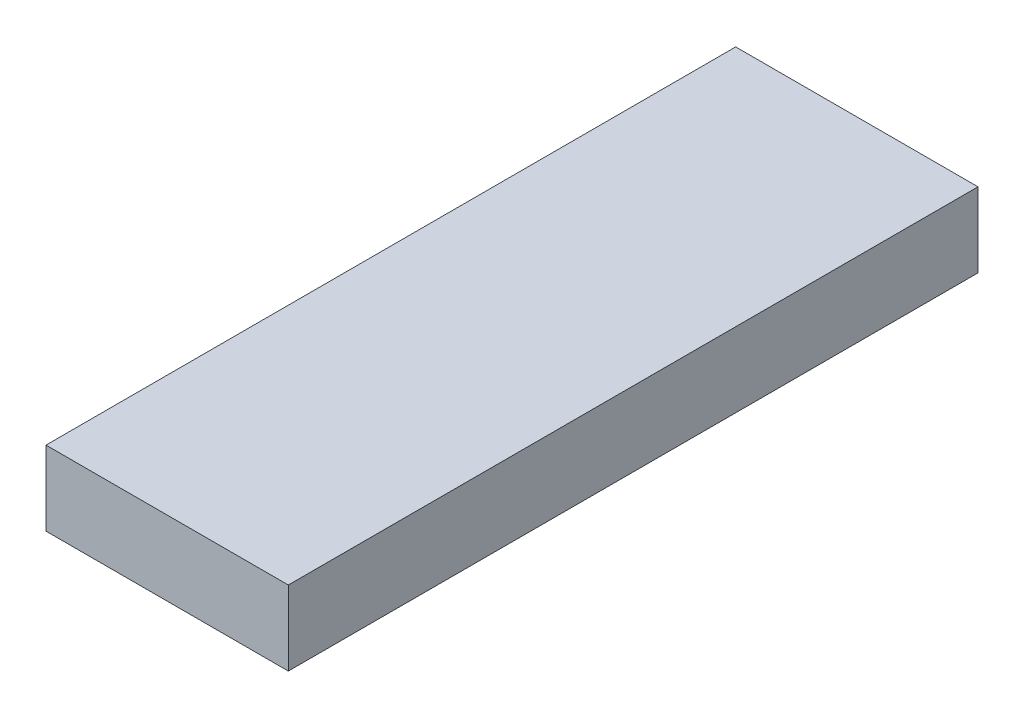
ISO-10303-21;
HEADER;
FILE_DESCRIPTION(('STEP AP214'),'2;1');
FILE_NAME('part.step','',(''),(''),'','','');
FILE_SCHEMA(('AUTOMOTIVE_DESIGN { 1 0 10303 214 1 1 1 1 }'));
ENDSEC;
DATA;
#1=APPLICATION_CONTEXT('core data for automotive mechanical design processes');
#2=APPLICATION_PROTOCOL_DEFINITION('international standard','automotive_design',2000,#1);
#3=PRODUCT_CONTEXT('',#1,'mechanical');
#4=PRODUCT('Part','Part','',(#3));
#5=PRODUCT_RELATED_PRODUCT_CATEGORY('part','',(#4));
#6=PRODUCT_DEFINITION_FORMATION('','',#4);
#7=PRODUCT_DEFINITION_CONTEXT('part definition',#1,'design');
#8=PRODUCT_DEFINITION('design','',#6,#7);
#9=PRODUCT_DEFINITION_SHAPE('','',#8);
#10=(LENGTH_UNIT() NAMED_UNIT(*) SI_UNIT(.MILLI.,.METRE.));
#11=(NAMED_UNIT(*) PLANE_ANGLE_UNIT() SI_UNIT($,.RADIAN.));
#12=(NAMED_UNIT(*) SI_UNIT($,.STERADIAN.) SOLID_ANGLE_UNIT());
#13=UNCERTAINTY_MEASURE_WITH_UNIT(LENGTH_MEASURE(1.E-05),#10,'distance_accuracy_value','');
#14=(GEOMETRIC_REPRESENTATION_CONTEXT(3) GLOBAL_UNCERTAINTY_ASSIGNED_CONTEXT((#13)) GLOBAL_UNIT_ASSIGNED_CONTEXT((#10,
#11,#12)) REPRESENTATION_CONTEXT('',''));
#15=CARTESIAN_POINT('',(0.,0.,0.));
#16=DIRECTION('',(0.,0.,1.));
#17=DIRECTION('',(1.,0.,0.));
#18=AXIS2_PLACEMENT_3D('',#15,#16,#17);
#19=CARTESIAN_POINT('',(0.,101.6,0.));
#20=DIRECTION('',(1.,0.,0.));
#21=DIRECTION('',(0.,0.,-1.));
#22=AXIS2_PLACEMENT_3D('',#19,#20,#21);
#23=PLANE('',#22);
#24=DIRECTION('',(0.,0.,1.));
#25=VECTOR('',#24,1.);
#26=CARTESIAN_POINT('',(0.,0.,0.));
#27=LINE('',#26,#25);
#28=CARTESIAN_POINT('',(0.,0.,-939.8));
#29=VERTEX_POINT('',#28);
#30=CARTESIAN_POINT('',(0.,0.,0.));
#31=VERTEX_POINT('',#30);
#32=EDGE_CURVE('E97',#29,#31,#27,.T.);
#33=ORIENTED_EDGE('',*,*,#32,.T.);
#34=DIRECTION('',(0.,-1.,0.));
#35=VECTOR('',#34,1.);
#36=CARTESIAN_POINT('',(0.,101.6,0.));
#37=LINE('',#36,#35);
#38=CARTESIAN_POINT('',(0.,101.6,0.));
#39=VERTEX_POINT('',#38);
#40=EDGE_CURVE('E11',#39,#31,#37,.T.);
#41=ORIENTED_EDGE('',*,*,#40,.F.);
#42=DIRECTION('',(0.,0.,1.));
#43=VECTOR('',#42,1.);
#44=CARTESIAN_POINT('',(0.,101.6,0.));
#45=LINE('',#44,#43);
#46=CARTESIAN_POINT('',(0.,101.6,-939.8));
#47=VERTEX_POINT('',#46);
#48=EDGE_CURVE('E85',#47,#39,#45,.T.);
#49=ORIENTED_EDGE('',*,*,#48,.F.);
#50=DIRECTION('',(0.,-1.,0.));
#51=VECTOR('',#50,1.);
#52=CARTESIAN_POINT('',(0.,101.6,-939.8));
#53=LINE('',#52,#51);
#54=EDGE_CURVE('E93',#47,#29,#53,.T.);
#55=ORIENTED_EDGE('',*,*,#54,.T.);
#56=EDGE_LOOP('',(#33,#41,#49,#55));
#57=FACE_BOUND('',#56,.T.);
#58=ADVANCED_FACE('F34',(#57),#23,.F.);
#59=CARTESIAN_POINT('',(0.,101.6,0.));
#60=DIRECTION('',(0.,0.,-1.));
#61=DIRECTION('',(-1.,0.,0.));
#62=AXIS2_PLACEMENT_3D('',#59,#60,#61);
#63=PLANE('',#62);
#64=DIRECTION('',(1.,0.,0.));
#65=VECTOR('',#64,1.);
#66=CARTESIAN_POINT('',(0.,0.,0.));
#67=LINE('',#66,#65);
#68=CARTESIAN_POINT('',(330.2,0.,0.));
#69=VERTEX_POINT('',#68);
#70=EDGE_CURVE('E89',#31,#69,#67,.T.);
#71=ORIENTED_EDGE('',*,*,#70,.T.);
#72=DIRECTION('',(0.,-1.,0.));
#73=VECTOR('',#72,1.);
#74=CARTESIAN_POINT('',(330.2,101.6,0.));
#75=LINE('',#74,#73);
#76=CARTESIAN_POINT('',(330.2,101.6,0.));
#77=VERTEX_POINT('',#76);
#78=EDGE_CURVE('E42',#77,#69,#75,.T.);
#79=ORIENTED_EDGE('',*,*,#78,.F.);
#80=DIRECTION('',(1.,0.,0.));
#81=VECTOR('',#80,1.);
#82=CARTESIAN_POINT('',(0.,101.6,0.));
#83=LINE('',#82,#81);
#84=EDGE_CURVE('E80',#39,#77,#83,.T.);
#85=ORIENTED_EDGE('',*,*,#84,.F.);
#86=ORIENTED_EDGE('',*,*,#40,.T.);
#87=EDGE_LOOP('',(#71,#79,#85,#86));
#88=FACE_BOUND('',#87,.T.);
#89=ADVANCED_FACE('F88',(#88),#63,.F.);
#90=CARTESIAN_POINT('',(330.2,101.6,0.));
#91=DIRECTION('',(-1.,0.,0.));
#92=DIRECTION('',(0.,0.,1.));
#93=AXIS2_PLACEMENT_3D('',#90,#91,#92);
#94=PLANE('',#93);
#95=DIRECTION('',(0.,0.,-1.));
#96=VECTOR('',#95,1.);
#97=CARTESIAN_POINT('',(330.2,0.,0.));
#98=LINE('',#97,#96);
#99=CARTESIAN_POINT('',(330.2,0.,-939.8));
#100=VERTEX_POINT('',#99);
#101=EDGE_CURVE('E67',#69,#100,#98,.T.);
#102=ORIENTED_EDGE('',*,*,#101,.T.);
#103=DIRECTION('',(0.,-1.,0.));
#104=VECTOR('',#103,1.);
#105=CARTESIAN_POINT('',(330.2,101.6,-939.8));
#106=LINE('',#105,#104);
#107=CARTESIAN_POINT('',(330.2,101.6,-939.8));
#108=VERTEX_POINT('',#107);
#109=EDGE_CURVE('E90',#108,#100,#106,.T.);
#110=ORIENTED_EDGE('',*,*,#109,.F.);
#111=DIRECTION('',(0.,0.,-1.));
#112=VECTOR('',#111,1.);
#113=CARTESIAN_POINT('',(330.2,101.6,0.));
#114=LINE('',#113,#112);
#115=EDGE_CURVE('E83',#77,#108,#114,.T.);
#116=ORIENTED_EDGE('',*,*,#115,.F.);
#117=ORIENTED_EDGE('',*,*,#78,.T.);
#118=EDGE_LOOP('',(#102,#110,#116,#117));
#119=FACE_BOUND('',#118,.T.);
#120=ADVANCED_FACE('F91',(#119),#94,.F.);
#121=CARTESIAN_POINT('',(0.,101.6,-939.8));
#122=DIRECTION('',(0.,0.,1.));
#123=DIRECTION('',(1.,0.,0.));
#124=AXIS2_PLACEMENT_3D('',#121,#122,#123);
#125=PLANE('',#124);
#126=DIRECTION('',(-1.,0.,0.));
#127=VECTOR('',#126,1.);
#128=CARTESIAN_POINT('',(0.,0.,-939.8));
#129=LINE('',#128,#127);
#130=EDGE_CURVE('E73',#100,#29,#129,.T.);
#131=ORIENTED_EDGE('',*,*,#130,.T.);
#132=ORIENTED_EDGE('',*,*,#54,.F.);
#133=DIRECTION('',(-1.,0.,0.));
#134=VECTOR('',#133,1.);
#135=CARTESIAN_POINT('',(0.,101.6,-939.8));
#136=LINE('',#135,#134);
#137=EDGE_CURVE('E50',#108,#47,#136,.T.);
#138=ORIENTED_EDGE('',*,*,#137,.F.);
#139=ORIENTED_EDGE('',*,*,#109,.T.);
#140=EDGE_LOOP('',(#131,#132,#138,#139));
#141=FACE_BOUND('',#140,.T.);
#142=ADVANCED_FACE('F104',(#141),#125,.F.);
#143=CARTESIAN_POINT('',(0.,101.6,0.));
#144=DIRECTION('',(0.,-1.,0.));
#145=DIRECTION('',(0.,0.,-1.));
#146=AXIS2_PLACEMENT_3D('',#143,#144,#145);
#147=PLANE('',#146);
#148=ORIENTED_EDGE('',*,*,#48,.T.);
#149=ORIENTED_EDGE('',*,*,#84,.T.);
#150=ORIENTED_EDGE('',*,*,#115,.T.);
#151=ORIENTED_EDGE('',*,*,#137,.T.);
#152=EDGE_LOOP('',(#148,#149,#150,#151));
#153=FACE_BOUND('',#152,.T.);
#154=ADVANCED_FACE('F81',(#153),#147,.F.);
#155=CARTESIAN_POINT('',(0.,0.,0.));
#156=DIRECTION('',(0.,-1.,0.));
#157=DIRECTION('',(0.,0.,-1.));
#158=AXIS2_PLACEMENT_3D('',#155,#156,#157);
#159=PLANE('',#158);
#160=ORIENTED_EDGE('',*,*,#32,.F.);
#161=ORIENTED_EDGE('',*,*,#130,.F.);
#162=ORIENTED_EDGE('',*,*,#101,.F.);
#163=ORIENTED_EDGE('',*,*,#70,.F.);
#164=EDGE_LOOP('',(#160,#161,#162,#163));
#165=FACE_BOUND('',#164,.T.);
#166=ADVANCED_FACE('F107',(#165),#159,.T.);
#167=CLOSED_SHELL('',(#58,#89,#120,#142,#154,#166));
#168=MANIFOLD_SOLID_BREP('B2',#167);
#169=ADVANCED_BREP_SHAPE_REPRESENTATION('',(#18,#168),#14);
#170=SHAPE_DEFINITION_REPRESENTATION(#9,#169);
ENDSEC;
END-ISO-10303-21;
